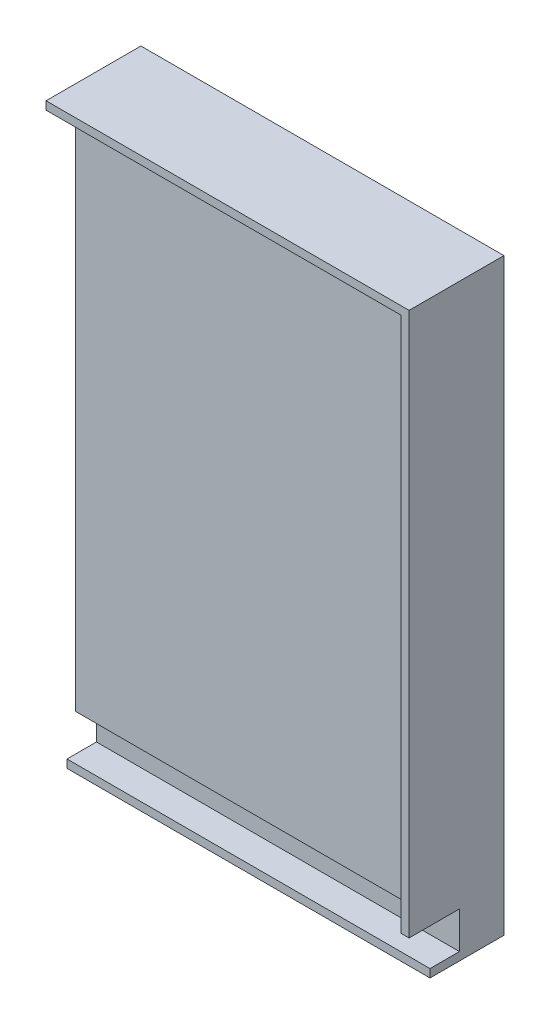
ISO-10303-21;
HEADER;
FILE_DESCRIPTION(('STEP AP214'),'2;1');
FILE_NAME('part.step','',(''),(''),'','','');
FILE_SCHEMA(('AUTOMOTIVE_DESIGN { 1 0 10303 214 1 1 1 1 }'));
ENDSEC;
DATA;
#1=APPLICATION_CONTEXT('core data for automotive mechanical design processes');
#2=APPLICATION_PROTOCOL_DEFINITION('international standard','automotive_design',2000,#1);
#3=PRODUCT_CONTEXT('',#1,'mechanical');
#4=PRODUCT('Part','Part','',(#3));
#5=PRODUCT_RELATED_PRODUCT_CATEGORY('part','',(#4));
#6=PRODUCT_DEFINITION_FORMATION('','',#4);
#7=PRODUCT_DEFINITION_CONTEXT('part definition',#1,'design');
#8=PRODUCT_DEFINITION('design','',#6,#7);
#9=PRODUCT_DEFINITION_SHAPE('','',#8);
#10=(LENGTH_UNIT() NAMED_UNIT(*) SI_UNIT(.MILLI.,.METRE.));
#11=(NAMED_UNIT(*) PLANE_ANGLE_UNIT() SI_UNIT($,.RADIAN.));
#12=(NAMED_UNIT(*) SI_UNIT($,.STERADIAN.) SOLID_ANGLE_UNIT());
#13=UNCERTAINTY_MEASURE_WITH_UNIT(LENGTH_MEASURE(1.E-05),#10,'distance_accuracy_value','');
#14=(GEOMETRIC_REPRESENTATION_CONTEXT(3) GLOBAL_UNCERTAINTY_ASSIGNED_CONTEXT((#13)) GLOBAL_UNIT_ASSIGNED_CONTEXT((#10,
#11,#12)) REPRESENTATION_CONTEXT('',''));
#15=CARTESIAN_POINT('',(0.,0.,0.));
#16=DIRECTION('',(0.,0.,1.));
#17=DIRECTION('',(1.,0.,0.));
#18=AXIS2_PLACEMENT_3D('',#15,#16,#17);
#19=CARTESIAN_POINT('',(72.6068292682926,-97.9603658536585,36.84));
#20=DIRECTION('',(-1.,0.,0.));
#21=DIRECTION('',(0.,-1.,0.));
#22=AXIS2_PLACEMENT_3D('',#19,#20,#21);
#23=PLANE('',#22);
#24=DIRECTION('',(0.,-1.,0.));
#25=VECTOR('',#24,1.);
#26=CARTESIAN_POINT('',(72.6068292682926,-94.7853658536585,28.702));
#27=LINE('',#26,#25);
#28=CARTESIAN_POINT('',(72.6068292682926,-94.7853658536585,28.702));
#29=VERTEX_POINT('',#28);
#30=CARTESIAN_POINT('',(72.6068292682926,-97.9603658536585,28.702));
#31=VERTEX_POINT('',#30);
#32=EDGE_CURVE('E110',#29,#31,#27,.T.);
#33=ORIENTED_EDGE('',*,*,#32,.F.);
#34=DIRECTION('',(0.,0.,1.));
#35=VECTOR('',#34,1.);
#36=CARTESIAN_POINT('',(72.6068292682926,-94.7853658536585,0.));
#37=LINE('',#36,#35);
#38=CARTESIAN_POINT('',(72.6068292682926,-94.7853658536585,17.272));
#39=VERTEX_POINT('',#38);
#40=EDGE_CURVE('E107',#39,#29,#37,.T.);
#41=ORIENTED_EDGE('',*,*,#40,.F.);
#42=DIRECTION('',(0.,1.,0.));
#43=VECTOR('',#42,1.);
#44=CARTESIAN_POINT('',(72.6068292682926,0.,17.272));
#45=LINE('',#44,#43);
#46=CARTESIAN_POINT('',(72.6068292682926,-80.4343658536585,17.272));
#47=VERTEX_POINT('',#46);
#48=EDGE_CURVE('E116',#39,#47,#45,.T.);
#49=ORIENTED_EDGE('',*,*,#48,.T.);
#50=DIRECTION('',(0.,0.,1.));
#51=VECTOR('',#50,1.);
#52=CARTESIAN_POINT('',(72.6068292682926,-80.4343658536585,17.272));
#53=LINE('',#52,#51);
#54=CARTESIAN_POINT('',(72.6068292682926,-80.4343658536585,25.4));
#55=VERTEX_POINT('',#54);
#56=EDGE_CURVE('E125',#47,#55,#53,.T.);
#57=ORIENTED_EDGE('',*,*,#56,.T.);
#58=DIRECTION('',(0.,-1.,0.));
#59=VECTOR('',#58,1.);
#60=CARTESIAN_POINT('',(72.6068292682926,0.,25.4));
#61=LINE('',#60,#59);
#62=CARTESIAN_POINT('',(72.6068292682926,127.464634146342,25.4));
#63=VERTEX_POINT('',#62);
#64=EDGE_CURVE('E104',#63,#55,#61,.T.);
#65=ORIENTED_EDGE('',*,*,#64,.F.);
#66=DIRECTION('',(0.,0.,-1.));
#67=VECTOR('',#66,1.);
#68=CARTESIAN_POINT('',(72.6068292682926,127.464634146342,0.));
#69=LINE('',#68,#67);
#70=CARTESIAN_POINT('',(72.6068292682926,127.464634146342,36.83));
#71=VERTEX_POINT('',#70);
#72=EDGE_CURVE('E100',#71,#63,#69,.T.);
#73=ORIENTED_EDGE('',*,*,#72,.F.);
#74=DIRECTION('',(0.,-1.,0.));
#75=VECTOR('',#74,1.);
#76=CARTESIAN_POINT('',(72.6068292682926,127.464634146342,36.83));
#77=LINE('',#76,#75);
#78=CARTESIAN_POINT('',(72.6068292682926,130.639634146342,36.83));
#79=VERTEX_POINT('',#78);
#80=EDGE_CURVE('E83',#79,#71,#77,.T.);
#81=ORIENTED_EDGE('',*,*,#80,.F.);
#82=DIRECTION('',(0.,0.,-1.));
#83=VECTOR('',#82,1.);
#84=CARTESIAN_POINT('',(72.6068292682926,130.639634146342,25.4));
#85=LINE('',#84,#83);
#86=CARTESIAN_POINT('',(72.6068292682926,130.639634146342,0.));
#87=VERTEX_POINT('',#86);
#88=EDGE_CURVE('E119',#79,#87,#85,.T.);
#89=ORIENTED_EDGE('',*,*,#88,.T.);
#90=DIRECTION('',(0.,-1.,0.));
#91=VECTOR('',#90,1.);
#92=CARTESIAN_POINT('',(72.6068292682926,0.,0.));
#93=LINE('',#92,#91);
#94=CARTESIAN_POINT('',(72.6068292682926,-97.9603658536585,0.));
#95=VERTEX_POINT('',#94);
#96=EDGE_CURVE('E122',#87,#95,#93,.T.);
#97=ORIENTED_EDGE('',*,*,#96,.T.);
#98=DIRECTION('',(0.,0.,1.));
#99=VECTOR('',#98,1.);
#100=CARTESIAN_POINT('',(72.6068292682926,-97.9603658536585,0.));
#101=LINE('',#100,#99);
#102=EDGE_CURVE('E113',#95,#31,#101,.T.);
#103=ORIENTED_EDGE('',*,*,#102,.T.);
#104=EDGE_LOOP('',(#33,#41,#49,#57,#65,#73,#81,#89,#97,#103));
#105=FACE_BOUND('',#104,.T.);
#106=ADVANCED_FACE('F39',(#105),#23,.T.);
#107=CARTESIAN_POINT('',(-68.3631707317073,-94.7853658536585,28.702));
#108=DIRECTION('',(0.,0.,1.));
#109=DIRECTION('',(1.,0.,0.));
#110=AXIS2_PLACEMENT_3D('',#107,#108,#109);
#111=PLANE('',#110);
#112=DIRECTION('',(-1.,0.,0.));
#113=VECTOR('',#112,1.);
#114=CARTESIAN_POINT('',(-68.3631707317073,-94.7853658536585,28.702));
#115=LINE('',#114,#113);
#116=CARTESIAN_POINT('',(213.576829268293,-94.7853658536585,28.702));
#117=VERTEX_POINT('',#116);
#118=EDGE_CURVE('E128',#117,#29,#115,.T.);
#119=ORIENTED_EDGE('',*,*,#118,.T.);
#120=ORIENTED_EDGE('',*,*,#32,.T.);
#121=DIRECTION('',(-1.,0.,0.));
#122=VECTOR('',#121,1.);
#123=CARTESIAN_POINT('',(-68.3631707317073,-97.9603658536585,28.702));
#124=LINE('',#123,#122);
#125=CARTESIAN_POINT('',(213.576829268293,-97.9603658536585,28.702));
#126=VERTEX_POINT('',#125);
#127=EDGE_CURVE('E135',#126,#31,#124,.T.);
#128=ORIENTED_EDGE('',*,*,#127,.F.);
#129=DIRECTION('',(0.,-1.,0.));
#130=VECTOR('',#129,1.);
#131=CARTESIAN_POINT('',(213.576829268293,-94.7853658536585,28.702));
#132=LINE('',#131,#130);
#133=EDGE_CURVE('E102',#117,#126,#132,.T.);
#134=ORIENTED_EDGE('',*,*,#133,.F.);
#135=EDGE_LOOP('',(#119,#120,#128,#134));
#136=FACE_BOUND('',#135,.T.);
#137=ADVANCED_FACE('F191',(#136),#111,.T.);
#138=CARTESIAN_POINT('',(0.,-94.7853658536585,0.));
#139=DIRECTION('',(0.,1.,0.));
#140=DIRECTION('',(0.,0.,1.));
#141=AXIS2_PLACEMENT_3D('',#138,#139,#140);
#142=PLANE('',#141);
#143=DIRECTION('',(1.,0.,0.));
#144=VECTOR('',#143,1.);
#145=CARTESIAN_POINT('',(213.576829268293,-94.7853658536585,17.272));
#146=LINE('',#145,#144);
#147=CARTESIAN_POINT('',(213.576829268293,-94.7853658536585,17.272));
#148=VERTEX_POINT('',#147);
#149=EDGE_CURVE('E132',#39,#148,#146,.T.);
#150=ORIENTED_EDGE('',*,*,#149,.F.);
#151=ORIENTED_EDGE('',*,*,#40,.T.);
#152=ORIENTED_EDGE('',*,*,#118,.F.);
#153=DIRECTION('',(0.,0.,1.));
#154=VECTOR('',#153,1.);
#155=CARTESIAN_POINT('',(213.576829268293,-94.7853658536585,28.702));
#156=LINE('',#155,#154);
#157=EDGE_CURVE('E131',#148,#117,#156,.T.);
#158=ORIENTED_EDGE('',*,*,#157,.F.);
#159=EDGE_LOOP('',(#150,#151,#152,#158));
#160=FACE_BOUND('',#159,.T.);
#161=ADVANCED_FACE('F247',(#160),#142,.T.);
#162=CARTESIAN_POINT('',(0.,-97.9603658536585,0.));
#163=DIRECTION('',(0.,1.,0.));
#164=DIRECTION('',(0.,0.,1.));
#165=AXIS2_PLACEMENT_3D('',#162,#163,#164);
#166=PLANE('',#165);
#167=ORIENTED_EDGE('',*,*,#102,.F.);
#168=DIRECTION('',(1.,0.,0.));
#169=VECTOR('',#168,1.);
#170=CARTESIAN_POINT('',(-68.3631707317073,-97.9603658536585,0.));
#171=LINE('',#170,#169);
#172=CARTESIAN_POINT('',(213.576829268293,-97.9603658536585,0.));
#173=VERTEX_POINT('',#172);
#174=EDGE_CURVE('E144',#95,#173,#171,.T.);
#175=ORIENTED_EDGE('',*,*,#174,.T.);
#176=DIRECTION('',(0.,0.,1.));
#177=VECTOR('',#176,1.);
#178=CARTESIAN_POINT('',(213.576829268293,-97.9603658536585,28.702));
#179=LINE('',#178,#177);
#180=EDGE_CURVE('E138',#173,#126,#179,.T.);
#181=ORIENTED_EDGE('',*,*,#180,.T.);
#182=ORIENTED_EDGE('',*,*,#127,.T.);
#183=EDGE_LOOP('',(#167,#175,#181,#182));
#184=FACE_BOUND('',#183,.T.);
#185=ADVANCED_FACE('F196',(#184),#166,.F.);
#186=CARTESIAN_POINT('',(0.,0.,17.272));
#187=DIRECTION('',(0.,0.,-1.));
#188=DIRECTION('',(-1.,0.,0.));
#189=AXIS2_PLACEMENT_3D('',#186,#187,#188);
#190=PLANE('',#189);
#191=ORIENTED_EDGE('',*,*,#48,.F.);
#192=ORIENTED_EDGE('',*,*,#149,.T.);
#193=DIRECTION('',(0.,1.,0.));
#194=VECTOR('',#193,1.);
#195=CARTESIAN_POINT('',(213.576829268293,-80.4343658536585,17.272));
#196=LINE('',#195,#194);
#197=CARTESIAN_POINT('',(213.576829268293,-80.4343658536585,17.272));
#198=VERTEX_POINT('',#197);
#199=EDGE_CURVE('E150',#148,#198,#196,.T.);
#200=ORIENTED_EDGE('',*,*,#199,.T.);
#201=DIRECTION('',(-1.,0.,0.));
#202=VECTOR('',#201,1.);
#203=CARTESIAN_POINT('',(-68.3631707317074,-80.4343658536585,17.272));
#204=LINE('',#203,#202);
#205=EDGE_CURVE('E147',#198,#47,#204,.T.);
#206=ORIENTED_EDGE('',*,*,#205,.T.);
#207=EDGE_LOOP('',(#191,#192,#200,#206));
#208=FACE_BOUND('',#207,.T.);
#209=ADVANCED_FACE('F227',(#208),#190,.F.);
#210=CARTESIAN_POINT('',(213.576829268293,-94.7853658536585,28.702));
#211=DIRECTION('',(1.,0.,0.));
#212=DIRECTION('',(0.,0.,-1.));
#213=AXIS2_PLACEMENT_3D('',#210,#211,#212);
#214=PLANE('',#213);
#215=ORIENTED_EDGE('',*,*,#180,.F.);
#216=DIRECTION('',(0.,1.,0.));
#217=VECTOR('',#216,1.);
#218=CARTESIAN_POINT('',(213.576829268293,130.639634146342,0.));
#219=LINE('',#218,#217);
#220=CARTESIAN_POINT('',(213.576829268293,130.639634146342,0.));
#221=VERTEX_POINT('',#220);
#222=EDGE_CURVE('E142',#173,#221,#219,.T.);
#223=ORIENTED_EDGE('',*,*,#222,.T.);
#224=DIRECTION('',(0.,0.,-1.));
#225=VECTOR('',#224,1.);
#226=CARTESIAN_POINT('',(213.576829268293,130.639634146342,25.4));
#227=LINE('',#226,#225);
#228=CARTESIAN_POINT('',(213.576829268293,130.639634146342,36.83));
#229=VERTEX_POINT('',#228);
#230=EDGE_CURVE('E143',#229,#221,#227,.T.);
#231=ORIENTED_EDGE('',*,*,#230,.F.);
#232=DIRECTION('',(0.,1.,0.));
#233=VECTOR('',#232,1.);
#234=CARTESIAN_POINT('',(213.576829268293,127.464634146342,36.83));
#235=LINE('',#234,#233);
#236=CARTESIAN_POINT('',(213.576829268293,-80.4343658536585,36.83));
#237=VERTEX_POINT('',#236);
#238=EDGE_CURVE('E88',#237,#229,#235,.T.);
#239=ORIENTED_EDGE('',*,*,#238,.F.);
#240=DIRECTION('',(0.,0.,1.));
#241=VECTOR('',#240,1.);
#242=CARTESIAN_POINT('',(213.576829268293,-80.4343658536585,17.272));
#243=LINE('',#242,#241);
#244=EDGE_CURVE('E57',#198,#237,#243,.T.);
#245=ORIENTED_EDGE('',*,*,#244,.F.);
#246=ORIENTED_EDGE('',*,*,#199,.F.);
#247=ORIENTED_EDGE('',*,*,#157,.T.);
#248=ORIENTED_EDGE('',*,*,#133,.T.);
#249=EDGE_LOOP('',(#215,#223,#231,#239,#245,#246,#247,#248));
#250=FACE_BOUND('',#249,.T.);
#251=ADVANCED_FACE('F181',(#250),#214,.T.);
#252=CARTESIAN_POINT('',(-68.3631707317074,-80.4343658536585,17.272));
#253=DIRECTION('',(0.,1.,0.));
#254=DIRECTION('',(0.,0.,1.));
#255=AXIS2_PLACEMENT_3D('',#252,#253,#254);
#256=PLANE('',#255);
#257=ORIENTED_EDGE('',*,*,#56,.F.);
#258=ORIENTED_EDGE('',*,*,#205,.F.);
#259=ORIENTED_EDGE('',*,*,#244,.T.);
#260=DIRECTION('',(1.,0.,0.));
#261=VECTOR('',#260,1.);
#262=CARTESIAN_POINT('',(210.401829268293,-80.4343658536585,36.83));
#263=LINE('',#262,#261);
#264=CARTESIAN_POINT('',(210.401829268293,-80.4343658536585,36.83));
#265=VERTEX_POINT('',#264);
#266=EDGE_CURVE('E156',#265,#237,#263,.T.);
#267=ORIENTED_EDGE('',*,*,#266,.F.);
#268=DIRECTION('',(0.,0.,-1.));
#269=VECTOR('',#268,1.);
#270=CARTESIAN_POINT('',(210.401829268293,-80.4343658536585,25.4));
#271=LINE('',#270,#269);
#272=CARTESIAN_POINT('',(210.401829268293,-80.4343658536585,25.4));
#273=VERTEX_POINT('',#272);
#274=EDGE_CURVE('E93',#265,#273,#271,.T.);
#275=ORIENTED_EDGE('',*,*,#274,.T.);
#276=DIRECTION('',(-1.,0.,0.));
#277=VECTOR('',#276,1.);
#278=CARTESIAN_POINT('',(-68.3631707317074,-80.4343658536585,25.4));
#279=LINE('',#278,#277);
#280=EDGE_CURVE('E151',#273,#55,#279,.T.);
#281=ORIENTED_EDGE('',*,*,#280,.T.);
#282=EDGE_LOOP('',(#257,#258,#259,#267,#275,#281));
#283=FACE_BOUND('',#282,.T.);
#284=ADVANCED_FACE('F229',(#283),#256,.F.);
#285=CARTESIAN_POINT('',(-68.3631707317074,130.639634146342,25.4));
#286=DIRECTION('',(0.,-1.,0.));
#287=DIRECTION('',(1.,0.,0.));
#288=AXIS2_PLACEMENT_3D('',#285,#286,#287);
#289=PLANE('',#288);
#290=ORIENTED_EDGE('',*,*,#88,.F.);
#291=DIRECTION('',(1.,0.,0.));
#292=VECTOR('',#291,1.);
#293=CARTESIAN_POINT('',(213.576829268293,130.639634146342,36.83));
#294=LINE('',#293,#292);
#295=EDGE_CURVE('E43',#79,#229,#294,.T.);
#296=ORIENTED_EDGE('',*,*,#295,.T.);
#297=ORIENTED_EDGE('',*,*,#230,.T.);
#298=DIRECTION('',(-1.,0.,0.));
#299=VECTOR('',#298,1.);
#300=CARTESIAN_POINT('',(-68.3631707317074,130.639634146342,0.));
#301=LINE('',#300,#299);
#302=EDGE_CURVE('E139',#221,#87,#301,.T.);
#303=ORIENTED_EDGE('',*,*,#302,.T.);
#304=EDGE_LOOP('',(#290,#296,#297,#303));
#305=FACE_BOUND('',#304,.T.);
#306=ADVANCED_FACE('F230',(#305),#289,.F.);
#307=CARTESIAN_POINT('',(210.401829268293,0.,0.));
#308=DIRECTION('',(-1.,0.,0.));
#309=DIRECTION('',(0.,0.,1.));
#310=AXIS2_PLACEMENT_3D('',#307,#308,#309);
#311=PLANE('',#310);
#312=DIRECTION('',(0.,1.,0.));
#313=VECTOR('',#312,1.);
#314=CARTESIAN_POINT('',(210.401829268293,127.464634146342,25.4));
#315=LINE('',#314,#313);
#316=CARTESIAN_POINT('',(210.401829268293,127.464634146342,25.4));
#317=VERTEX_POINT('',#316);
#318=EDGE_CURVE('E11',#273,#317,#315,.T.);
#319=ORIENTED_EDGE('',*,*,#318,.F.);
#320=ORIENTED_EDGE('',*,*,#274,.F.);
#321=DIRECTION('',(0.,-1.,0.));
#322=VECTOR('',#321,1.);
#323=CARTESIAN_POINT('',(210.401829268293,-80.4343658536585,36.83));
#324=LINE('',#323,#322);
#325=CARTESIAN_POINT('',(210.401829268293,127.464634146342,36.83));
#326=VERTEX_POINT('',#325);
#327=EDGE_CURVE('E79',#326,#265,#324,.T.);
#328=ORIENTED_EDGE('',*,*,#327,.F.);
#329=DIRECTION('',(0.,0.,1.));
#330=VECTOR('',#329,1.);
#331=CARTESIAN_POINT('',(210.401829268293,127.464634146342,36.83));
#332=LINE('',#331,#330);
#333=EDGE_CURVE('E49',#317,#326,#332,.T.);
#334=ORIENTED_EDGE('',*,*,#333,.F.);
#335=EDGE_LOOP('',(#319,#320,#328,#334));
#336=FACE_BOUND('',#335,.T.);
#337=ADVANCED_FACE('F91',(#336),#311,.T.);
#338=CARTESIAN_POINT('',(0.,0.,25.4));
#339=DIRECTION('',(0.,0.,1.));
#340=DIRECTION('',(1.,0.,0.));
#341=AXIS2_PLACEMENT_3D('',#338,#339,#340);
#342=PLANE('',#341);
#343=DIRECTION('',(-1.,0.,0.));
#344=VECTOR('',#343,1.);
#345=CARTESIAN_POINT('',(-65.1881707317074,127.464634146342,25.4));
#346=LINE('',#345,#344);
#347=EDGE_CURVE('E87',#317,#63,#346,.T.);
#348=ORIENTED_EDGE('',*,*,#347,.T.);
#349=ORIENTED_EDGE('',*,*,#64,.T.);
#350=ORIENTED_EDGE('',*,*,#280,.F.);
#351=ORIENTED_EDGE('',*,*,#318,.T.);
#352=EDGE_LOOP('',(#348,#349,#350,#351));
#353=FACE_BOUND('',#352,.T.);
#354=ADVANCED_FACE('F235',(#353),#342,.T.);
#355=CARTESIAN_POINT('',(213.576829268293,127.464634146342,36.83));
#356=DIRECTION('',(0.,0.,1.));
#357=DIRECTION('',(1.,0.,0.));
#358=AXIS2_PLACEMENT_3D('',#355,#356,#357);
#359=PLANE('',#358);
#360=ORIENTED_EDGE('',*,*,#295,.F.);
#361=ORIENTED_EDGE('',*,*,#80,.T.);
#362=DIRECTION('',(1.,0.,0.));
#363=VECTOR('',#362,1.);
#364=CARTESIAN_POINT('',(213.576829268293,127.464634146342,36.83));
#365=LINE('',#364,#363);
#366=EDGE_CURVE('E74',#71,#326,#365,.T.);
#367=ORIENTED_EDGE('',*,*,#366,.T.);
#368=ORIENTED_EDGE('',*,*,#327,.T.);
#369=ORIENTED_EDGE('',*,*,#266,.T.);
#370=ORIENTED_EDGE('',*,*,#238,.T.);
#371=EDGE_LOOP('',(#360,#361,#367,#368,#369,#370));
#372=FACE_BOUND('',#371,.T.);
#373=ADVANCED_FACE('F77',(#372),#359,.T.);
#374=CARTESIAN_POINT('',(0.,127.464634146342,0.));
#375=DIRECTION('',(0.,-1.,0.));
#376=DIRECTION('',(1.,0.,0.));
#377=AXIS2_PLACEMENT_3D('',#374,#375,#376);
#378=PLANE('',#377);
#379=ORIENTED_EDGE('',*,*,#366,.F.);
#380=ORIENTED_EDGE('',*,*,#72,.T.);
#381=ORIENTED_EDGE('',*,*,#347,.F.);
#382=ORIENTED_EDGE('',*,*,#333,.T.);
#383=EDGE_LOOP('',(#379,#380,#381,#382));
#384=FACE_BOUND('',#383,.T.);
#385=ADVANCED_FACE('F41',(#384),#378,.T.);
#386=CARTESIAN_POINT('',(0.,0.,0.));
#387=DIRECTION('',(0.,0.,1.));
#388=DIRECTION('',(1.,0.,0.));
#389=AXIS2_PLACEMENT_3D('',#386,#387,#388);
#390=PLANE('',#389);
#391=ORIENTED_EDGE('',*,*,#96,.F.);
#392=ORIENTED_EDGE('',*,*,#302,.F.);
#393=ORIENTED_EDGE('',*,*,#222,.F.);
#394=ORIENTED_EDGE('',*,*,#174,.F.);
#395=EDGE_LOOP('',(#391,#392,#393,#394));
#396=FACE_BOUND('',#395,.T.);
#397=ADVANCED_FACE('F204',(#396),#390,.F.);
#398=CLOSED_SHELL('',(#106,#137,#161,#185,#209,#251,#284,#306,#337,#354,#373,#385,#397));
#399=MANIFOLD_SOLID_BREP('B2',#398);
#400=ADVANCED_BREP_SHAPE_REPRESENTATION('',(#18,#399),#14);
#401=SHAPE_DEFINITION_REPRESENTATION(#9,#400);
ENDSEC;
END-ISO-10303-21;
